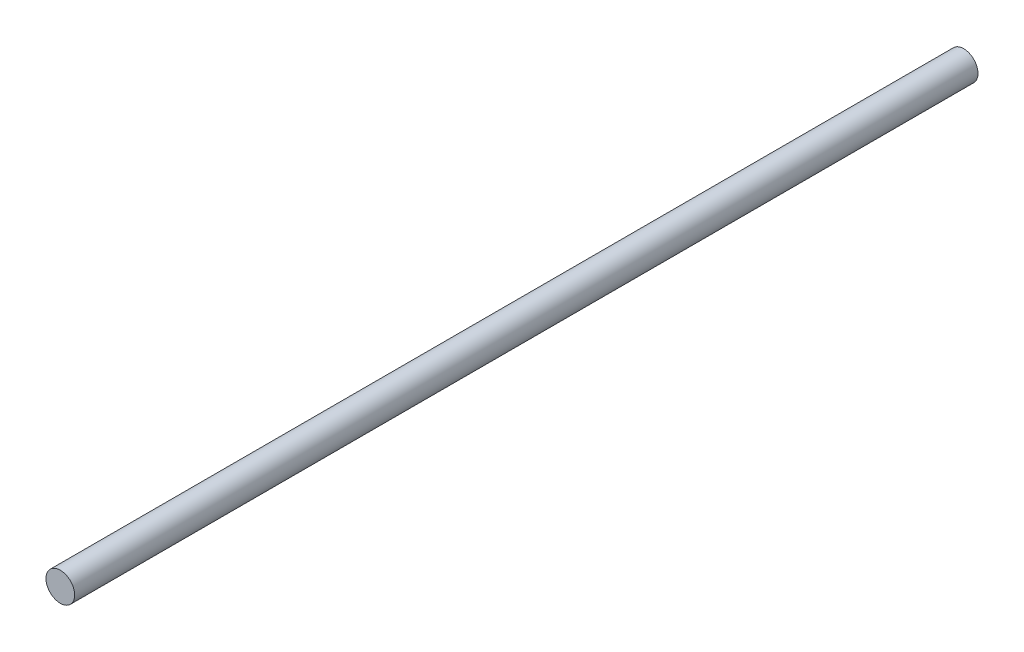
ISO-10303-21;
HEADER;
FILE_DESCRIPTION(('STEP AP214'),'2;1');
FILE_NAME('part.step','',(''),(''),'','','');
FILE_SCHEMA(('AUTOMOTIVE_DESIGN { 1 0 10303 214 1 1 1 1 }'));
ENDSEC;
DATA;
#1=APPLICATION_CONTEXT('core data for automotive mechanical design processes');
#2=APPLICATION_PROTOCOL_DEFINITION('international standard','automotive_design',2000,#1);
#3=PRODUCT_CONTEXT('',#1,'mechanical');
#4=PRODUCT('Part','Part','',(#3));
#5=PRODUCT_RELATED_PRODUCT_CATEGORY('part','',(#4));
#6=PRODUCT_DEFINITION_FORMATION('','',#4);
#7=PRODUCT_DEFINITION_CONTEXT('part definition',#1,'design');
#8=PRODUCT_DEFINITION('design','',#6,#7);
#9=PRODUCT_DEFINITION_SHAPE('','',#8);
#10=(LENGTH_UNIT() NAMED_UNIT(*) SI_UNIT(.MILLI.,.METRE.));
#11=(NAMED_UNIT(*) PLANE_ANGLE_UNIT() SI_UNIT($,.RADIAN.));
#12=(NAMED_UNIT(*) SI_UNIT($,.STERADIAN.) SOLID_ANGLE_UNIT());
#13=UNCERTAINTY_MEASURE_WITH_UNIT(LENGTH_MEASURE(1.E-05),#10,'distance_accuracy_value','');
#14=(GEOMETRIC_REPRESENTATION_CONTEXT(3) GLOBAL_UNCERTAINTY_ASSIGNED_CONTEXT((#13)) GLOBAL_UNIT_ASSIGNED_CONTEXT((#10,
#11,#12)) REPRESENTATION_CONTEXT('',''));
#15=CARTESIAN_POINT('',(0.,0.,0.));
#16=DIRECTION('',(0.,0.,1.));
#17=DIRECTION('',(1.,0.,0.));
#18=AXIS2_PLACEMENT_3D('',#15,#16,#17);
#19=CARTESIAN_POINT('',(0.,0.,100.));
#20=DIRECTION('',(0.,0.,-1.));
#21=DIRECTION('',(-1.,0.,0.));
#22=AXIS2_PLACEMENT_3D('',#19,#20,#21);
#23=CYLINDRICAL_SURFACE('',#22,1.5875);
#24=CARTESIAN_POINT('',(0.,0.,100.));
#25=DIRECTION('',(0.,0.,1.));
#26=DIRECTION('',(1.,0.,0.));
#27=AXIS2_PLACEMENT_3D('',#24,#25,#26);
#28=CIRCLE('',#27,1.5875);
#29=CARTESIAN_POINT('',(1.5875,0.,100.));
#30=VERTEX_POINT('',#29);
#31=EDGE_CURVE('E10',#30,#30,#28,.T.);
#32=ORIENTED_EDGE('',*,*,#31,.F.);
#33=EDGE_LOOP('',(#32));
#34=FACE_BOUND('',#33,.T.);
#35=CARTESIAN_POINT('',(0.,0.,0.));
#36=DIRECTION('',(0.,0.,1.));
#37=DIRECTION('',(1.,0.,0.));
#38=AXIS2_PLACEMENT_3D('',#35,#36,#37);
#39=CIRCLE('',#38,1.5875);
#40=CARTESIAN_POINT('',(1.5875,0.,0.));
#41=VERTEX_POINT('',#40);
#42=EDGE_CURVE('E34',#41,#41,#39,.T.);
#43=ORIENTED_EDGE('',*,*,#42,.T.);
#44=EDGE_LOOP('',(#43));
#45=FACE_BOUND('',#44,.T.);
#46=ADVANCED_FACE('F31',(#34,#45),#23,.T.);
#47=CARTESIAN_POINT('',(0.,0.,100.));
#48=DIRECTION('',(0.,0.,1.));
#49=DIRECTION('',(1.,0.,0.));
#50=AXIS2_PLACEMENT_3D('',#47,#48,#49);
#51=PLANE('',#50);
#52=ORIENTED_EDGE('',*,*,#31,.T.);
#53=EDGE_LOOP('',(#52));
#54=FACE_BOUND('',#53,.T.);
#55=ADVANCED_FACE('F46',(#54),#51,.T.);
#56=CARTESIAN_POINT('',(0.,0.,0.));
#57=DIRECTION('',(0.,0.,1.));
#58=DIRECTION('',(1.,0.,0.));
#59=AXIS2_PLACEMENT_3D('',#56,#57,#58);
#60=PLANE('',#59);
#61=ORIENTED_EDGE('',*,*,#42,.F.);
#62=EDGE_LOOP('',(#61));
#63=FACE_BOUND('',#62,.T.);
#64=ADVANCED_FACE('F44',(#63),#60,.F.);
#65=CLOSED_SHELL('',(#46,#55,#64));
#66=MANIFOLD_SOLID_BREP('B2',#65);
#67=ADVANCED_BREP_SHAPE_REPRESENTATION('',(#18,#66),#14);
#68=SHAPE_DEFINITION_REPRESENTATION(#9,#67);
ENDSEC;
END-ISO-10303-21;
